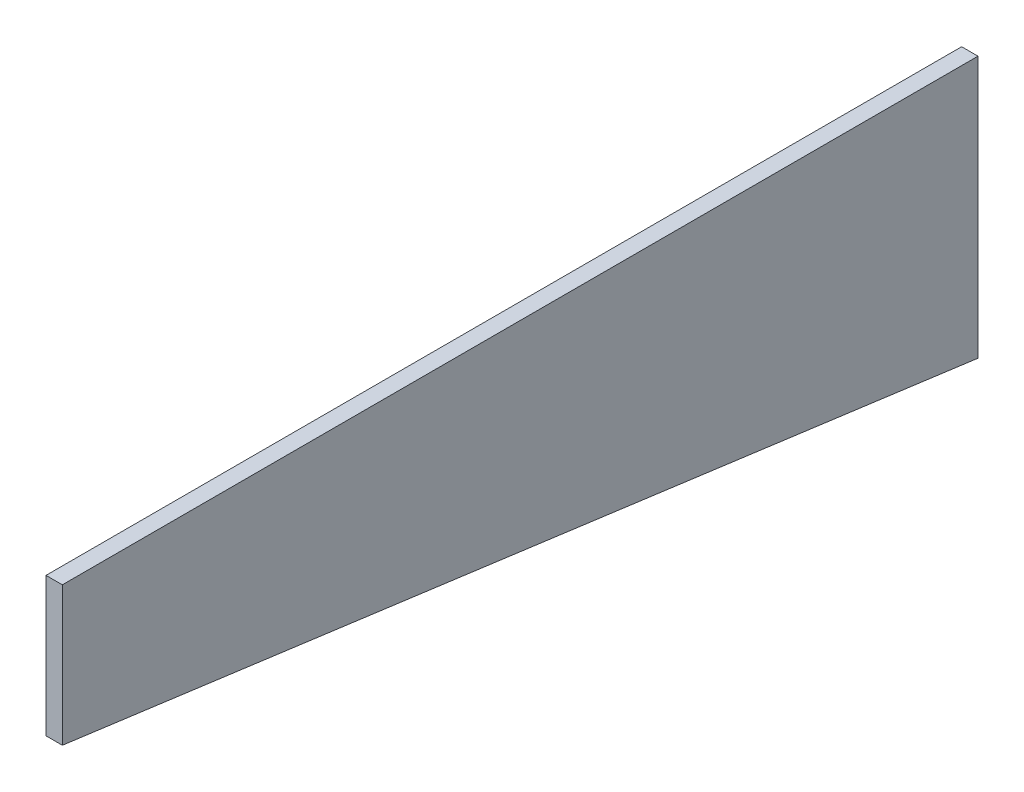
ISO-10303-21;
HEADER;
FILE_DESCRIPTION(('STEP AP214'),'2;1');
FILE_NAME('part.step','',(''),(''),'','','');
FILE_SCHEMA(('AUTOMOTIVE_DESIGN { 1 0 10303 214 1 1 1 1 }'));
ENDSEC;
DATA;
#1=APPLICATION_CONTEXT('core data for automotive mechanical design processes');
#2=APPLICATION_PROTOCOL_DEFINITION('international standard','automotive_design',2000,#1);
#3=PRODUCT_CONTEXT('',#1,'mechanical');
#4=PRODUCT('Part','Part','',(#3));
#5=PRODUCT_RELATED_PRODUCT_CATEGORY('part','',(#4));
#6=PRODUCT_DEFINITION_FORMATION('','',#4);
#7=PRODUCT_DEFINITION_CONTEXT('part definition',#1,'design');
#8=PRODUCT_DEFINITION('design','',#6,#7);
#9=PRODUCT_DEFINITION_SHAPE('','',#8);
#10=(LENGTH_UNIT() NAMED_UNIT(*) SI_UNIT(.MILLI.,.METRE.));
#11=(NAMED_UNIT(*) PLANE_ANGLE_UNIT() SI_UNIT($,.RADIAN.));
#12=(NAMED_UNIT(*) SI_UNIT($,.STERADIAN.) SOLID_ANGLE_UNIT());
#13=UNCERTAINTY_MEASURE_WITH_UNIT(LENGTH_MEASURE(1.E-05),#10,'distance_accuracy_value','');
#14=(GEOMETRIC_REPRESENTATION_CONTEXT(3) GLOBAL_UNCERTAINTY_ASSIGNED_CONTEXT((#13)) GLOBAL_UNIT_ASSIGNED_CONTEXT((#10,
#11,#12)) REPRESENTATION_CONTEXT('',''));
#15=CARTESIAN_POINT('',(0.,0.,0.));
#16=DIRECTION('',(0.,0.,1.));
#17=DIRECTION('',(1.,0.,0.));
#18=AXIS2_PLACEMENT_3D('',#15,#16,#17);
#19=CARTESIAN_POINT('',(6.35,0.,0.));
#20=DIRECTION('',(1.,0.,0.));
#21=DIRECTION('',(0.,0.,-1.));
#22=AXIS2_PLACEMENT_3D('',#19,#20,#21);
#23=PLANE('',#22);
#24=DIRECTION('',(0.,0.,1.));
#25=VECTOR('',#24,1.);
#26=CARTESIAN_POINT('',(6.35,0.,-355.6));
#27=LINE('',#26,#25);
#28=CARTESIAN_POINT('',(6.35,0.,0.));
#29=VERTEX_POINT('',#28);
#30=CARTESIAN_POINT('',(6.35,0.,-355.6));
#31=VERTEX_POINT('',#30);
#32=EDGE_CURVE('E68',#29,#31,#27,.F.);
#33=ORIENTED_EDGE('',*,*,#32,.F.);
#34=DIRECTION('',(0.,1.,0.));
#35=VECTOR('',#34,1.);
#36=CARTESIAN_POINT('',(6.35,0.,0.));
#37=LINE('',#36,#35);
#38=CARTESIAN_POINT('',(6.35,-53.975,0.));
#39=VERTEX_POINT('',#38);
#40=EDGE_CURVE('E20',#39,#29,#37,.T.);
#41=ORIENTED_EDGE('',*,*,#40,.F.);
#42=DIRECTION('',(0.,-0.132743362831896,-0.991150442477871));
#43=VECTOR('',#42,1.);
#44=CARTESIAN_POINT('',(6.35,-53.975,0.));
#45=LINE('',#44,#43);
#46=CARTESIAN_POINT('',(6.35,-101.600000000003,-355.6));
#47=VERTEX_POINT('',#46);
#48=EDGE_CURVE('E58',#47,#39,#45,.F.);
#49=ORIENTED_EDGE('',*,*,#48,.F.);
#50=DIRECTION('',(0.,1.,0.));
#51=VECTOR('',#50,1.);
#52=CARTESIAN_POINT('',(6.35,-101.6,-355.6));
#53=LINE('',#52,#51);
#54=EDGE_CURVE('E53',#31,#47,#53,.F.);
#55=ORIENTED_EDGE('',*,*,#54,.F.);
#56=EDGE_LOOP('',(#33,#41,#49,#55));
#57=FACE_BOUND('',#56,.T.);
#58=ADVANCED_FACE('F17',(#57),#23,.T.);
#59=CARTESIAN_POINT('',(0.,0.,0.));
#60=DIRECTION('',(0.,0.,1.));
#61=DIRECTION('',(1.,0.,0.));
#62=AXIS2_PLACEMENT_3D('',#59,#60,#61);
#63=PLANE('',#62);
#64=DIRECTION('',(1.,0.,0.));
#65=VECTOR('',#64,1.);
#66=CARTESIAN_POINT('',(0.,0.,0.));
#67=LINE('',#66,#65);
#68=CARTESIAN_POINT('',(0.,0.,0.));
#69=VERTEX_POINT('',#68);
#70=EDGE_CURVE('E79',#69,#29,#67,.T.);
#71=ORIENTED_EDGE('',*,*,#70,.F.);
#72=DIRECTION('',(0.,1.,0.));
#73=VECTOR('',#72,1.);
#74=CARTESIAN_POINT('',(0.,0.,0.));
#75=LINE('',#74,#73);
#76=CARTESIAN_POINT('',(0.,-53.975,0.));
#77=VERTEX_POINT('',#76);
#78=EDGE_CURVE('E74',#69,#77,#75,.F.);
#79=ORIENTED_EDGE('',*,*,#78,.T.);
#80=DIRECTION('',(1.,0.,0.));
#81=VECTOR('',#80,1.);
#82=CARTESIAN_POINT('',(0.,-53.975,0.));
#83=LINE('',#82,#81);
#84=EDGE_CURVE('E63',#39,#77,#83,.F.);
#85=ORIENTED_EDGE('',*,*,#84,.F.);
#86=ORIENTED_EDGE('',*,*,#40,.T.);
#87=EDGE_LOOP('',(#71,#79,#85,#86));
#88=FACE_BOUND('',#87,.T.);
#89=ADVANCED_FACE('F73',(#88),#63,.T.);
#90=CARTESIAN_POINT('',(0.,-53.975,0.));
#91=DIRECTION('',(0.,-0.991150442477871,0.132743362831896));
#92=DIRECTION('',(0.,-0.132743362831896,-0.991150442477871));
#93=AXIS2_PLACEMENT_3D('',#90,#91,#92);
#94=PLANE('',#93);
#95=ORIENTED_EDGE('',*,*,#84,.T.);
#96=DIRECTION('',(0.,-0.132743362831858,-0.991150442477876));
#97=VECTOR('',#96,1.);
#98=CARTESIAN_POINT('',(0.,-53.975,0.));
#99=LINE('',#98,#97);
#100=CARTESIAN_POINT('',(0.,-101.600000000007,-355.599999999999));
#101=VERTEX_POINT('',#100);
#102=EDGE_CURVE('E84',#77,#101,#99,.T.);
#103=ORIENTED_EDGE('',*,*,#102,.T.);
#104=DIRECTION('',(-1.,0.,0.));
#105=VECTOR('',#104,1.);
#106=CARTESIAN_POINT('',(0.,-101.6,-355.6));
#107=LINE('',#106,#105);
#108=EDGE_CURVE('E65',#47,#101,#107,.T.);
#109=ORIENTED_EDGE('',*,*,#108,.F.);
#110=ORIENTED_EDGE('',*,*,#48,.T.);
#111=EDGE_LOOP('',(#95,#103,#109,#110));
#112=FACE_BOUND('',#111,.T.);
#113=ADVANCED_FACE('F60',(#112),#94,.T.);
#114=CARTESIAN_POINT('',(0.,-101.6,-355.6));
#115=DIRECTION('',(0.,0.,-1.));
#116=DIRECTION('',(-1.,0.,0.));
#117=AXIS2_PLACEMENT_3D('',#114,#115,#116);
#118=PLANE('',#117);
#119=ORIENTED_EDGE('',*,*,#108,.T.);
#120=DIRECTION('',(0.,1.,0.));
#121=VECTOR('',#120,1.);
#122=CARTESIAN_POINT('',(0.,0.,-355.6));
#123=LINE('',#122,#121);
#124=CARTESIAN_POINT('',(0.,0.,-355.6));
#125=VERTEX_POINT('',#124);
#126=EDGE_CURVE('E26',#101,#125,#123,.T.);
#127=ORIENTED_EDGE('',*,*,#126,.T.);
#128=DIRECTION('',(1.,0.,0.));
#129=VECTOR('',#128,1.);
#130=CARTESIAN_POINT('',(0.,0.,-355.6));
#131=LINE('',#130,#129);
#132=EDGE_CURVE('E34',#31,#125,#131,.F.);
#133=ORIENTED_EDGE('',*,*,#132,.F.);
#134=ORIENTED_EDGE('',*,*,#54,.T.);
#135=EDGE_LOOP('',(#119,#127,#133,#134));
#136=FACE_BOUND('',#135,.T.);
#137=ADVANCED_FACE('F88',(#136),#118,.T.);
#138=CARTESIAN_POINT('',(0.,0.,-355.6));
#139=DIRECTION('',(0.,1.,0.));
#140=DIRECTION('',(0.,0.,1.));
#141=AXIS2_PLACEMENT_3D('',#138,#139,#140);
#142=PLANE('',#141);
#143=ORIENTED_EDGE('',*,*,#132,.T.);
#144=DIRECTION('',(0.,0.,-1.));
#145=VECTOR('',#144,1.);
#146=CARTESIAN_POINT('',(0.,0.,0.));
#147=LINE('',#146,#145);
#148=EDGE_CURVE('E11',#125,#69,#147,.F.);
#149=ORIENTED_EDGE('',*,*,#148,.T.);
#150=ORIENTED_EDGE('',*,*,#70,.T.);
#151=ORIENTED_EDGE('',*,*,#32,.T.);
#152=EDGE_LOOP('',(#143,#149,#150,#151));
#153=FACE_BOUND('',#152,.T.);
#154=ADVANCED_FACE('F91',(#153),#142,.T.);
#155=CARTESIAN_POINT('',(0.,0.,0.));
#156=DIRECTION('',(1.,0.,0.));
#157=DIRECTION('',(0.,0.,-1.));
#158=AXIS2_PLACEMENT_3D('',#155,#156,#157);
#159=PLANE('',#158);
#160=ORIENTED_EDGE('',*,*,#126,.F.);
#161=ORIENTED_EDGE('',*,*,#102,.F.);
#162=ORIENTED_EDGE('',*,*,#78,.F.);
#163=ORIENTED_EDGE('',*,*,#148,.F.);
#164=EDGE_LOOP('',(#160,#161,#162,#163));
#165=FACE_BOUND('',#164,.T.);
#166=ADVANCED_FACE('F90',(#165),#159,.F.);
#167=CLOSED_SHELL('',(#58,#89,#113,#137,#154,#166));
#168=MANIFOLD_SOLID_BREP('B1',#167);
#169=ADVANCED_BREP_SHAPE_REPRESENTATION('',(#18,#168),#14);
#170=SHAPE_DEFINITION_REPRESENTATION(#9,#169);
ENDSEC;
END-ISO-10303-21;
